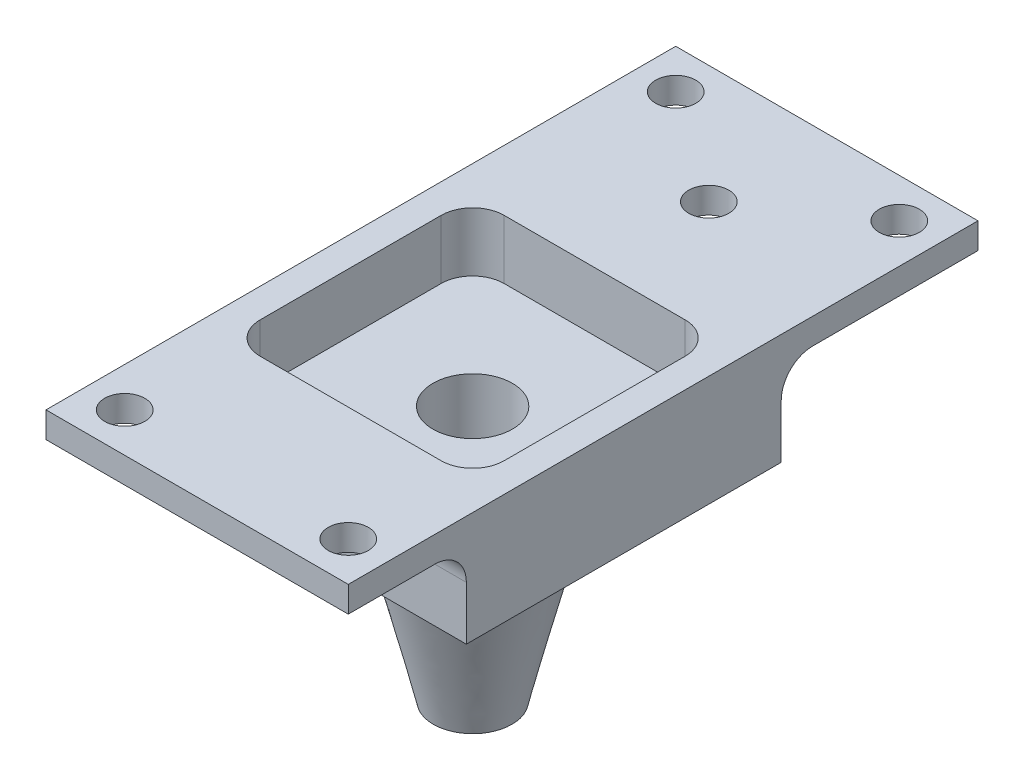
ISO-10303-21;
HEADER;
FILE_DESCRIPTION(('STEP AP214'),'2;1');
FILE_NAME('part.step','',(''),(''),'','','');
FILE_SCHEMA(('AUTOMOTIVE_DESIGN { 1 0 10303 214 1 1 1 1 }'));
ENDSEC;
DATA;
#1=APPLICATION_CONTEXT('core data for automotive mechanical design processes');
#2=APPLICATION_PROTOCOL_DEFINITION('international standard','automotive_design',2000,#1);
#3=PRODUCT_CONTEXT('',#1,'mechanical');
#4=PRODUCT('Part','Part','',(#3));
#5=PRODUCT_RELATED_PRODUCT_CATEGORY('part','',(#4));
#6=PRODUCT_DEFINITION_FORMATION('','',#4);
#7=PRODUCT_DEFINITION_CONTEXT('part definition',#1,'design');
#8=PRODUCT_DEFINITION('design','',#6,#7);
#9=PRODUCT_DEFINITION_SHAPE('','',#8);
#10=(LENGTH_UNIT() NAMED_UNIT(*) SI_UNIT(.MILLI.,.METRE.));
#11=(NAMED_UNIT(*) PLANE_ANGLE_UNIT() SI_UNIT($,.RADIAN.));
#12=(NAMED_UNIT(*) SI_UNIT($,.STERADIAN.) SOLID_ANGLE_UNIT());
#13=UNCERTAINTY_MEASURE_WITH_UNIT(LENGTH_MEASURE(1.E-05),#10,'distance_accuracy_value','');
#14=(GEOMETRIC_REPRESENTATION_CONTEXT(3) GLOBAL_UNCERTAINTY_ASSIGNED_CONTEXT((#13)) GLOBAL_UNIT_ASSIGNED_CONTEXT((#10,
#11,#12)) REPRESENTATION_CONTEXT('',''));
#15=CARTESIAN_POINT('',(0.,0.,0.));
#16=DIRECTION('',(0.,0.,1.));
#17=DIRECTION('',(1.,0.,0.));
#18=AXIS2_PLACEMENT_3D('',#15,#16,#17);
#19=CARTESIAN_POINT('',(-24.384,0.,50.8));
#20=DIRECTION('',(1.,0.,0.));
#21=DIRECTION('',(0.,0.,-1.));
#22=AXIS2_PLACEMENT_3D('',#19,#20,#21);
#23=PLANE('',#22);
#24=DIRECTION('',(0.,0.,-1.));
#25=VECTOR('',#24,1.);
#26=CARTESIAN_POINT('',(-24.384,-3.55599999999999,50.8));
#27=LINE('',#26,#25);
#28=CARTESIAN_POINT('',(-24.384,-3.556,31.75));
#29=VERTEX_POINT('',#28);
#30=CARTESIAN_POINT('',(-24.384,-3.55599999999999,-19.05));
#31=VERTEX_POINT('',#30);
#32=EDGE_CURVE('E241',#29,#31,#27,.T.);
#33=ORIENTED_EDGE('',*,*,#32,.F.);
#34=DIRECTION('',(0.,-1.,0.));
#35=VECTOR('',#34,1.);
#36=CARTESIAN_POINT('',(-24.384,10.16,31.75));
#37=LINE('',#36,#35);
#38=CARTESIAN_POINT('',(-24.384,5.08,31.75));
#39=VERTEX_POINT('',#38);
#40=EDGE_CURVE('E252',#39,#29,#37,.T.);
#41=ORIENTED_EDGE('',*,*,#40,.F.);
#42=CARTESIAN_POINT('',(-24.384,5.08,36.83));
#43=DIRECTION('',(1.,0.,0.));
#44=DIRECTION('',(0.,0.,-1.));
#45=AXIS2_PLACEMENT_3D('',#42,#43,#44);
#46=CIRCLE('',#45,5.08);
#47=CARTESIAN_POINT('',(-24.384,10.16,36.83));
#48=VERTEX_POINT('',#47);
#49=EDGE_CURVE('E349',#39,#48,#46,.T.);
#50=ORIENTED_EDGE('',*,*,#49,.T.);
#51=DIRECTION('',(0.,0.,1.));
#52=VECTOR('',#51,1.);
#53=CARTESIAN_POINT('',(-24.384,10.16,50.8));
#54=LINE('',#53,#52);
#55=CARTESIAN_POINT('',(-24.384,10.16,50.8));
#56=VERTEX_POINT('',#55);
#57=EDGE_CURVE('E267',#48,#56,#54,.T.);
#58=ORIENTED_EDGE('',*,*,#57,.T.);
#59=DIRECTION('',(0.,-1.,0.));
#60=VECTOR('',#59,1.);
#61=CARTESIAN_POINT('',(-24.384,0.,50.8));
#62=LINE('',#61,#60);
#63=CARTESIAN_POINT('',(-24.384,14.3256,50.8));
#64=VERTEX_POINT('',#63);
#65=EDGE_CURVE('E299',#64,#56,#62,.T.);
#66=ORIENTED_EDGE('',*,*,#65,.F.);
#67=DIRECTION('',(0.,0.,-1.));
#68=VECTOR('',#67,1.);
#69=CARTESIAN_POINT('',(-24.384,14.3256,50.8));
#70=LINE('',#69,#68);
#71=CARTESIAN_POINT('',(-24.384,14.3256,-50.8));
#72=VERTEX_POINT('',#71);
#73=EDGE_CURVE('E314',#64,#72,#70,.T.);
#74=ORIENTED_EDGE('',*,*,#73,.T.);
#75=DIRECTION('',(0.,-1.,0.));
#76=VECTOR('',#75,1.);
#77=CARTESIAN_POINT('',(-24.384,0.,-50.8));
#78=LINE('',#77,#76);
#79=CARTESIAN_POINT('',(-24.384,10.16,-50.8));
#80=VERTEX_POINT('',#79);
#81=EDGE_CURVE('E308',#72,#80,#78,.T.);
#82=ORIENTED_EDGE('',*,*,#81,.T.);
#83=DIRECTION('',(0.,0.,1.));
#84=VECTOR('',#83,1.);
#85=CARTESIAN_POINT('',(-24.384,10.16,50.8));
#86=LINE('',#85,#84);
#87=CARTESIAN_POINT('',(-24.384,10.16,-24.13));
#88=VERTEX_POINT('',#87);
#89=EDGE_CURVE('E274',#80,#88,#86,.T.);
#90=ORIENTED_EDGE('',*,*,#89,.T.);
#91=CARTESIAN_POINT('',(-24.384,5.08,-24.13));
#92=DIRECTION('',(1.,0.,0.));
#93=DIRECTION('',(0.,0.,-1.));
#94=AXIS2_PLACEMENT_3D('',#91,#92,#93);
#95=CIRCLE('',#94,5.08);
#96=CARTESIAN_POINT('',(-24.384,5.08,-19.05));
#97=VERTEX_POINT('',#96);
#98=EDGE_CURVE('E345',#88,#97,#95,.T.);
#99=ORIENTED_EDGE('',*,*,#98,.T.);
#100=DIRECTION('',(0.,-1.,0.));
#101=VECTOR('',#100,1.);
#102=CARTESIAN_POINT('',(-24.384,10.16,-19.05));
#103=LINE('',#102,#101);
#104=EDGE_CURVE('E255',#97,#31,#103,.T.);
#105=ORIENTED_EDGE('',*,*,#104,.T.);
#106=EDGE_LOOP('',(#33,#41,#50,#58,#66,#74,#82,#90,#99,#105));
#107=FACE_BOUND('',#106,.T.);
#108=ADVANCED_FACE('F114',(#107),#23,.F.);
#109=CARTESIAN_POINT('',(24.384,0.,50.8));
#110=DIRECTION('',(-1.,0.,0.));
#111=DIRECTION('',(0.,0.,1.));
#112=AXIS2_PLACEMENT_3D('',#109,#110,#111);
#113=PLANE('',#112);
#114=DIRECTION('',(0.,0.,1.));
#115=VECTOR('',#114,1.);
#116=CARTESIAN_POINT('',(24.384,-3.55599999999999,50.8));
#117=LINE('',#116,#115);
#118=CARTESIAN_POINT('',(24.384,-3.55599999999999,-19.05));
#119=VERTEX_POINT('',#118);
#120=CARTESIAN_POINT('',(24.384,-3.55599999999999,31.75));
#121=VERTEX_POINT('',#120);
#122=EDGE_CURVE('E129',#119,#121,#117,.T.);
#123=ORIENTED_EDGE('',*,*,#122,.F.);
#124=DIRECTION('',(0.,-1.,0.));
#125=VECTOR('',#124,1.);
#126=CARTESIAN_POINT('',(24.384,10.16,-19.05));
#127=LINE('',#126,#125);
#128=CARTESIAN_POINT('',(24.384,5.08,-19.05));
#129=VERTEX_POINT('',#128);
#130=EDGE_CURVE('E280',#129,#119,#127,.T.);
#131=ORIENTED_EDGE('',*,*,#130,.F.);
#132=CARTESIAN_POINT('',(24.384,5.08,-24.13));
#133=DIRECTION('',(-1.,0.,0.));
#134=DIRECTION('',(0.,0.,1.));
#135=AXIS2_PLACEMENT_3D('',#132,#133,#134);
#136=CIRCLE('',#135,5.08);
#137=CARTESIAN_POINT('',(24.384,10.16,-24.13));
#138=VERTEX_POINT('',#137);
#139=EDGE_CURVE('E343',#129,#138,#136,.T.);
#140=ORIENTED_EDGE('',*,*,#139,.T.);
#141=DIRECTION('',(0.,0.,-1.));
#142=VECTOR('',#141,1.);
#143=CARTESIAN_POINT('',(24.384,10.16,50.8));
#144=LINE('',#143,#142);
#145=CARTESIAN_POINT('',(24.384,10.16,-50.8));
#146=VERTEX_POINT('',#145);
#147=EDGE_CURVE('E278',#138,#146,#144,.T.);
#148=ORIENTED_EDGE('',*,*,#147,.T.);
#149=DIRECTION('',(0.,1.,0.));
#150=VECTOR('',#149,1.);
#151=CARTESIAN_POINT('',(24.384,0.,-50.8));
#152=LINE('',#151,#150);
#153=CARTESIAN_POINT('',(24.384,14.3256,-50.8));
#154=VERTEX_POINT('',#153);
#155=EDGE_CURVE('E300',#146,#154,#152,.T.);
#156=ORIENTED_EDGE('',*,*,#155,.T.);
#157=DIRECTION('',(0.,0.,-1.));
#158=VECTOR('',#157,1.);
#159=CARTESIAN_POINT('',(24.384,14.3256,50.8));
#160=LINE('',#159,#158);
#161=CARTESIAN_POINT('',(24.384,14.3256,50.8));
#162=VERTEX_POINT('',#161);
#163=EDGE_CURVE('E305',#162,#154,#160,.T.);
#164=ORIENTED_EDGE('',*,*,#163,.F.);
#165=DIRECTION('',(0.,1.,0.));
#166=VECTOR('',#165,1.);
#167=CARTESIAN_POINT('',(24.384,0.,50.8));
#168=LINE('',#167,#166);
#169=CARTESIAN_POINT('',(24.384,10.16,50.8));
#170=VERTEX_POINT('',#169);
#171=EDGE_CURVE('E303',#170,#162,#168,.T.);
#172=ORIENTED_EDGE('',*,*,#171,.F.);
#173=DIRECTION('',(0.,0.,-1.));
#174=VECTOR('',#173,1.);
#175=CARTESIAN_POINT('',(24.384,10.16,50.8));
#176=LINE('',#175,#174);
#177=CARTESIAN_POINT('',(24.384,10.16,36.83));
#178=VERTEX_POINT('',#177);
#179=EDGE_CURVE('E284',#170,#178,#176,.T.);
#180=ORIENTED_EDGE('',*,*,#179,.T.);
#181=CARTESIAN_POINT('',(24.384,5.08,36.83));
#182=DIRECTION('',(-1.,0.,0.));
#183=DIRECTION('',(0.,0.,1.));
#184=AXIS2_PLACEMENT_3D('',#181,#182,#183);
#185=CIRCLE('',#184,5.08);
#186=CARTESIAN_POINT('',(24.384,5.08,31.75));
#187=VERTEX_POINT('',#186);
#188=EDGE_CURVE('E347',#178,#187,#185,.T.);
#189=ORIENTED_EDGE('',*,*,#188,.T.);
#190=DIRECTION('',(0.,-1.,0.));
#191=VECTOR('',#190,1.);
#192=CARTESIAN_POINT('',(24.384,10.16,31.75));
#193=LINE('',#192,#191);
#194=EDGE_CURVE('E261',#187,#121,#193,.T.);
#195=ORIENTED_EDGE('',*,*,#194,.T.);
#196=EDGE_LOOP('',(#123,#131,#140,#148,#156,#164,#172,#180,#189,#195));
#197=FACE_BOUND('',#196,.T.);
#198=ADVANCED_FACE('F375',(#197),#113,.F.);
#199=CARTESIAN_POINT('',(0.,10.16,-19.05));
#200=DIRECTION('',(0.,0.,-1.));
#201=DIRECTION('',(-1.,0.,0.));
#202=AXIS2_PLACEMENT_3D('',#199,#200,#201);
#203=PLANE('',#202);
#204=ORIENTED_EDGE('',*,*,#130,.T.);
#205=DIRECTION('',(-1.,0.,0.));
#206=VECTOR('',#205,1.);
#207=CARTESIAN_POINT('',(0.,-3.55599999999999,-19.05));
#208=LINE('',#207,#206);
#209=EDGE_CURVE('E256',#119,#31,#208,.T.);
#210=ORIENTED_EDGE('',*,*,#209,.T.);
#211=ORIENTED_EDGE('',*,*,#104,.F.);
#212=DIRECTION('',(1.,0.,0.));
#213=VECTOR('',#212,1.);
#214=CARTESIAN_POINT('',(0.,5.08,-19.05));
#215=LINE('',#214,#213);
#216=EDGE_CURVE('E316',#97,#129,#215,.T.);
#217=ORIENTED_EDGE('',*,*,#216,.T.);
#218=EDGE_LOOP('',(#204,#210,#211,#217));
#219=FACE_BOUND('',#218,.T.);
#220=ADVANCED_FACE('F380',(#219),#203,.T.);
#221=CARTESIAN_POINT('',(0.,10.16,31.75));
#222=DIRECTION('',(0.,0.,-1.));
#223=DIRECTION('',(-1.,0.,0.));
#224=AXIS2_PLACEMENT_3D('',#221,#222,#223);
#225=PLANE('',#224);
#226=DIRECTION('',(-1.,0.,0.));
#227=VECTOR('',#226,1.);
#228=CARTESIAN_POINT('',(0.,-3.55599999999999,31.75));
#229=LINE('',#228,#227);
#230=EDGE_CURVE('E238',#121,#29,#229,.T.);
#231=ORIENTED_EDGE('',*,*,#230,.F.);
#232=ORIENTED_EDGE('',*,*,#194,.F.);
#233=DIRECTION('',(1.,0.,0.));
#234=VECTOR('',#233,1.);
#235=CARTESIAN_POINT('',(0.,5.08,31.75));
#236=LINE('',#235,#234);
#237=EDGE_CURVE('E260',#187,#39,#236,.F.);
#238=ORIENTED_EDGE('',*,*,#237,.T.);
#239=ORIENTED_EDGE('',*,*,#40,.T.);
#240=EDGE_LOOP('',(#231,#232,#238,#239));
#241=FACE_BOUND('',#240,.T.);
#242=ADVANCED_FACE('F258',(#241),#225,.F.);
#243=CARTESIAN_POINT('',(0.,-36.4744,6.35));
#244=DIRECTION('',(0.,1.,0.));
#245=DIRECTION('',(0.,0.,1.));
#246=AXIS2_PLACEMENT_3D('',#243,#244,#245);
#247=PLANE('',#246);
#248=CARTESIAN_POINT('',(0.,-36.4744,6.35));
#249=DIRECTION('',(0.,1.,0.));
#250=DIRECTION('',(0.,0.,1.));
#251=AXIS2_PLACEMENT_3D('',#248,#249,#250);
#252=CIRCLE('',#251,6.35);
#253=CARTESIAN_POINT('',(-6.24832481410187,-36.4744,7.48178488127329));
#254=VERTEX_POINT('',#253);
#255=EDGE_CURVE('E530',#254,#254,#252,.T.);
#256=ORIENTED_EDGE('',*,*,#255,.F.);
#257=EDGE_LOOP('',(#256));
#258=FACE_BOUND('',#257,.T.);
#259=CARTESIAN_POINT('',(0.,-36.4744,6.35));
#260=DIRECTION('',(0.,1.,0.));
#261=DIRECTION('',(0.,0.,1.));
#262=AXIS2_PLACEMENT_3D('',#259,#260,#261);
#263=CIRCLE('',#262,3.2385);
#264=CARTESIAN_POINT('',(0.,-36.4744,9.5885));
#265=VERTEX_POINT('',#264);
#266=EDGE_CURVE('E527',#265,#265,#263,.T.);
#267=ORIENTED_EDGE('',*,*,#266,.T.);
#268=EDGE_LOOP('',(#267));
#269=FACE_BOUND('',#268,.T.);
#270=ADVANCED_FACE('F554',(#258,#269),#247,.F.);
#271=CARTESIAN_POINT('',(0.,-11.177,6.35));
#272=DIRECTION('',(0.,1.,0.));
#273=DIRECTION('',(0.,0.,1.));
#274=AXIS2_PLACEMENT_3D('',#271,#272,#273);
#275=CYLINDRICAL_SURFACE('',#274,6.4135);
#276=CARTESIAN_POINT('',(0.,-11.176,6.35));
#277=DIRECTION('',(0.,-1.,0.));
#278=DIRECTION('',(1.,0.,0.));
#279=AXIS2_PLACEMENT_3D('',#276,#277,#278);
#280=CIRCLE('',#279,6.4135);
#281=CARTESIAN_POINT('',(6.4135,-11.176,6.35));
#282=VERTEX_POINT('',#281);
#283=EDGE_CURVE('E524',#282,#282,#280,.T.);
#284=ORIENTED_EDGE('',*,*,#283,.T.);
#285=EDGE_LOOP('',(#284));
#286=FACE_BOUND('',#285,.T.);
#287=CARTESIAN_POINT('',(0.,4.80059999999999,6.35));
#288=DIRECTION('',(0.,1.,0.));
#289=DIRECTION('',(0.,0.,1.));
#290=AXIS2_PLACEMENT_3D('',#287,#288,#289);
#291=CIRCLE('',#290,6.4135);
#292=CARTESIAN_POINT('',(0.,4.80059999999999,12.7635));
#293=VERTEX_POINT('',#292);
#294=EDGE_CURVE('E357',#293,#293,#291,.F.);
#295=ORIENTED_EDGE('',*,*,#294,.F.);
#296=EDGE_LOOP('',(#295));
#297=FACE_BOUND('',#296,.T.);
#298=ADVANCED_FACE('F562',(#286,#297),#275,.F.);
#299=CARTESIAN_POINT('',(0.,0.,50.8));
#300=DIRECTION('',(0.,0.,1.));
#301=DIRECTION('',(1.,0.,0.));
#302=AXIS2_PLACEMENT_3D('',#299,#300,#301);
#303=PLANE('',#302);
#304=ORIENTED_EDGE('',*,*,#65,.T.);
#305=DIRECTION('',(1.,0.,0.));
#306=VECTOR('',#305,1.);
#307=CARTESIAN_POINT('',(0.,10.16,50.8));
#308=LINE('',#307,#306);
#309=EDGE_CURVE('E262',#56,#170,#308,.T.);
#310=ORIENTED_EDGE('',*,*,#309,.T.);
#311=ORIENTED_EDGE('',*,*,#171,.T.);
#312=DIRECTION('',(1.,0.,0.));
#313=VECTOR('',#312,1.);
#314=CARTESIAN_POINT('',(0.,14.3256,50.8));
#315=LINE('',#314,#313);
#316=EDGE_CURVE('E296',#64,#162,#315,.T.);
#317=ORIENTED_EDGE('',*,*,#316,.F.);
#318=EDGE_LOOP('',(#304,#310,#311,#317));
#319=FACE_BOUND('',#318,.T.);
#320=ADVANCED_FACE('F389',(#319),#303,.T.);
#321=CARTESIAN_POINT('',(0.,14.3256,50.8));
#322=DIRECTION('',(0.,1.,0.));
#323=DIRECTION('',(0.,0.,1.));
#324=AXIS2_PLACEMENT_3D('',#321,#322,#323);
#325=PLANE('',#324);
#326=CARTESIAN_POINT('',(0.,14.3256,-31.75));
#327=DIRECTION('',(0.,1.,0.));
#328=DIRECTION('',(0.,0.,1.));
#329=AXIS2_PLACEMENT_3D('',#326,#327,#328);
#330=CIRCLE('',#329,3.2385);
#331=CARTESIAN_POINT('',(0.,14.3256,-28.5115));
#332=VERTEX_POINT('',#331);
#333=EDGE_CURVE('E359',#332,#332,#330,.T.);
#334=ORIENTED_EDGE('',*,*,#333,.F.);
#335=EDGE_LOOP('',(#334));
#336=FACE_BOUND('',#335,.T.);
#337=CARTESIAN_POINT('',(18.034,14.3256,44.45));
#338=DIRECTION('',(0.,1.,0.));
#339=DIRECTION('',(0.,0.,1.));
#340=AXIS2_PLACEMENT_3D('',#337,#338,#339);
#341=CIRCLE('',#340,3.2385);
#342=CARTESIAN_POINT('',(18.034,14.3256,47.6885));
#343=VERTEX_POINT('',#342);
#344=EDGE_CURVE('E472',#343,#343,#341,.T.);
#345=ORIENTED_EDGE('',*,*,#344,.F.);
#346=EDGE_LOOP('',(#345));
#347=FACE_BOUND('',#346,.T.);
#348=CARTESIAN_POINT('',(-18.0340000000003,14.3256,-44.45));
#349=DIRECTION('',(0.,1.,0.));
#350=DIRECTION('',(0.,0.,1.));
#351=AXIS2_PLACEMENT_3D('',#348,#349,#350);
#352=CIRCLE('',#351,3.2385);
#353=CARTESIAN_POINT('',(-18.0340000000003,14.3256,-41.2115));
#354=VERTEX_POINT('',#353);
#355=EDGE_CURVE('E471',#354,#354,#352,.T.);
#356=ORIENTED_EDGE('',*,*,#355,.F.);
#357=EDGE_LOOP('',(#356));
#358=FACE_BOUND('',#357,.T.);
#359=CARTESIAN_POINT('',(18.0339999999997,14.3256,-44.45));
#360=DIRECTION('',(0.,1.,0.));
#361=DIRECTION('',(0.,0.,1.));
#362=AXIS2_PLACEMENT_3D('',#359,#360,#361);
#363=CIRCLE('',#362,3.2385);
#364=CARTESIAN_POINT('',(18.0339999999997,14.3256,-41.2115));
#365=VERTEX_POINT('',#364);
#366=EDGE_CURVE('E468',#365,#365,#363,.T.);
#367=ORIENTED_EDGE('',*,*,#366,.F.);
#368=EDGE_LOOP('',(#367));
#369=FACE_BOUND('',#368,.T.);
#370=CARTESIAN_POINT('',(-18.034,14.3256,44.45));
#371=DIRECTION('',(0.,1.,0.));
#372=DIRECTION('',(0.,0.,1.));
#373=AXIS2_PLACEMENT_3D('',#370,#371,#372);
#374=CIRCLE('',#373,3.2385);
#375=CARTESIAN_POINT('',(-18.034,14.3256,47.6885));
#376=VERTEX_POINT('',#375);
#377=EDGE_CURVE('E475',#376,#376,#374,.T.);
#378=ORIENTED_EDGE('',*,*,#377,.F.);
#379=EDGE_LOOP('',(#378));
#380=FACE_BOUND('',#379,.T.);
#381=DIRECTION('',(1.,0.,0.));
#382=VECTOR('',#381,1.);
#383=CARTESIAN_POINT('',(0.,14.3256,-50.8));
#384=LINE('',#383,#382);
#385=EDGE_CURVE('E294',#72,#154,#384,.T.);
#386=ORIENTED_EDGE('',*,*,#385,.F.);
#387=ORIENTED_EDGE('',*,*,#73,.F.);
#388=ORIENTED_EDGE('',*,*,#316,.T.);
#389=ORIENTED_EDGE('',*,*,#163,.T.);
#390=EDGE_LOOP('',(#386,#387,#388,#389));
#391=FACE_BOUND('',#390,.T.);
#392=DIRECTION('',(0.,0.,1.));
#393=VECTOR('',#392,1.);
#394=CARTESIAN_POINT('',(-19.685,14.3256,-13.335));
#395=LINE('',#394,#393);
#396=CARTESIAN_POINT('',(-19.685,14.3256,-8.255));
#397=VERTEX_POINT('',#396);
#398=CARTESIAN_POINT('',(-19.685,14.3256,20.955));
#399=VERTEX_POINT('',#398);
#400=EDGE_CURVE('E290',#397,#399,#395,.T.);
#401=ORIENTED_EDGE('',*,*,#400,.F.);
#402=CARTESIAN_POINT('',(-14.605,14.3256,-8.255));
#403=DIRECTION('',(0.,1.,0.));
#404=DIRECTION('',(0.,0.,1.));
#405=AXIS2_PLACEMENT_3D('',#402,#403,#404);
#406=CIRCLE('',#405,5.08);
#407=CARTESIAN_POINT('',(-14.605,14.3256,-13.335));
#408=VERTEX_POINT('',#407);
#409=EDGE_CURVE('E247',#397,#408,#406,.F.);
#410=ORIENTED_EDGE('',*,*,#409,.T.);
#411=DIRECTION('',(1.,0.,0.));
#412=VECTOR('',#411,1.);
#413=CARTESIAN_POINT('',(0.,14.3256,-13.335));
#414=LINE('',#413,#412);
#415=CARTESIAN_POINT('',(14.605,14.3256,-13.335));
#416=VERTEX_POINT('',#415);
#417=EDGE_CURVE('E287',#408,#416,#414,.T.);
#418=ORIENTED_EDGE('',*,*,#417,.T.);
#419=CARTESIAN_POINT('',(14.605,14.3256,-8.255));
#420=DIRECTION('',(0.,1.,0.));
#421=DIRECTION('',(0.,0.,1.));
#422=AXIS2_PLACEMENT_3D('',#419,#420,#421);
#423=CIRCLE('',#422,5.08);
#424=CARTESIAN_POINT('',(19.685,14.3256,-8.255));
#425=VERTEX_POINT('',#424);
#426=EDGE_CURVE('E353',#416,#425,#423,.F.);
#427=ORIENTED_EDGE('',*,*,#426,.T.);
#428=DIRECTION('',(0.,0.,1.));
#429=VECTOR('',#428,1.);
#430=CARTESIAN_POINT('',(19.685,14.3256,-13.335));
#431=LINE('',#430,#429);
#432=CARTESIAN_POINT('',(19.685,14.3256,20.955));
#433=VERTEX_POINT('',#432);
#434=EDGE_CURVE('E291',#425,#433,#431,.T.);
#435=ORIENTED_EDGE('',*,*,#434,.T.);
#436=CARTESIAN_POINT('',(14.605,14.3256,20.955));
#437=DIRECTION('',(0.,1.,0.));
#438=DIRECTION('',(0.,0.,1.));
#439=AXIS2_PLACEMENT_3D('',#436,#437,#438);
#440=CIRCLE('',#439,5.08);
#441=CARTESIAN_POINT('',(14.605,14.3256,26.035));
#442=VERTEX_POINT('',#441);
#443=EDGE_CURVE('E351',#433,#442,#440,.F.);
#444=ORIENTED_EDGE('',*,*,#443,.T.);
#445=DIRECTION('',(1.,0.,0.));
#446=VECTOR('',#445,1.);
#447=CARTESIAN_POINT('',(0.,14.3256,26.035));
#448=LINE('',#447,#446);
#449=CARTESIAN_POINT('',(-14.605,14.3256,26.035));
#450=VERTEX_POINT('',#449);
#451=EDGE_CURVE('E264',#450,#442,#448,.T.);
#452=ORIENTED_EDGE('',*,*,#451,.F.);
#453=CARTESIAN_POINT('',(-14.605,14.3256,20.955));
#454=DIRECTION('',(0.,1.,0.));
#455=DIRECTION('',(0.,0.,1.));
#456=AXIS2_PLACEMENT_3D('',#453,#454,#455);
#457=CIRCLE('',#456,5.08);
#458=EDGE_CURVE('E137',#450,#399,#457,.F.);
#459=ORIENTED_EDGE('',*,*,#458,.T.);
#460=EDGE_LOOP('',(#401,#410,#418,#427,#435,#444,#452,#459));
#461=FACE_BOUND('',#460,.T.);
#462=ADVANCED_FACE('F385',(#336,#347,#358,#369,#380,#391,#461),#325,.T.);
#463=CARTESIAN_POINT('',(0.,0.,-50.8));
#464=DIRECTION('',(0.,0.,1.));
#465=DIRECTION('',(1.,0.,0.));
#466=AXIS2_PLACEMENT_3D('',#463,#464,#465);
#467=PLANE('',#466);
#468=ORIENTED_EDGE('',*,*,#155,.F.);
#469=DIRECTION('',(-1.,0.,0.));
#470=VECTOR('',#469,1.);
#471=CARTESIAN_POINT('',(0.,10.16,-50.8));
#472=LINE('',#471,#470);
#473=EDGE_CURVE('E271',#146,#80,#472,.T.);
#474=ORIENTED_EDGE('',*,*,#473,.T.);
#475=ORIENTED_EDGE('',*,*,#81,.F.);
#476=ORIENTED_EDGE('',*,*,#385,.T.);
#477=EDGE_LOOP('',(#468,#474,#475,#476));
#478=FACE_BOUND('',#477,.T.);
#479=ADVANCED_FACE('F388',(#478),#467,.F.);
#480=CARTESIAN_POINT('',(19.685,0.,-13.335));
#481=DIRECTION('',(1.,0.,0.));
#482=DIRECTION('',(0.,1.,0.));
#483=AXIS2_PLACEMENT_3D('',#480,#481,#482);
#484=PLANE('',#483);
#485=DIRECTION('',(0.,1.,0.));
#486=VECTOR('',#485,1.);
#487=CARTESIAN_POINT('',(19.685,0.,-8.255));
#488=LINE('',#487,#486);
#489=CARTESIAN_POINT('',(19.685,4.80059999999999,-8.255));
#490=VERTEX_POINT('',#489);
#491=EDGE_CURVE('E325',#425,#490,#488,.F.);
#492=ORIENTED_EDGE('',*,*,#491,.T.);
#493=DIRECTION('',(0.,0.,-1.));
#494=VECTOR('',#493,1.);
#495=CARTESIAN_POINT('',(19.685,4.80059999999999,20.955));
#496=LINE('',#495,#494);
#497=CARTESIAN_POINT('',(19.685,4.80059999999999,20.955));
#498=VERTEX_POINT('',#497);
#499=EDGE_CURVE('E440',#498,#490,#496,.T.);
#500=ORIENTED_EDGE('',*,*,#499,.F.);
#501=DIRECTION('',(0.,1.,0.));
#502=VECTOR('',#501,1.);
#503=CARTESIAN_POINT('',(19.685,14.3256,20.955));
#504=LINE('',#503,#502);
#505=EDGE_CURVE('E327',#498,#433,#504,.T.);
#506=ORIENTED_EDGE('',*,*,#505,.T.);
#507=ORIENTED_EDGE('',*,*,#434,.F.);
#508=EDGE_LOOP('',(#492,#500,#506,#507));
#509=FACE_BOUND('',#508,.T.);
#510=ADVANCED_FACE('F438',(#509),#484,.F.);
#511=CARTESIAN_POINT('',(-19.685,0.,-13.335));
#512=DIRECTION('',(-1.,0.,0.));
#513=DIRECTION('',(0.,-1.,0.));
#514=AXIS2_PLACEMENT_3D('',#511,#512,#513);
#515=PLANE('',#514);
#516=ORIENTED_EDGE('',*,*,#400,.T.);
#517=DIRECTION('',(0.,-1.,0.));
#518=VECTOR('',#517,1.);
#519=CARTESIAN_POINT('',(-19.685,10.16,20.955));
#520=LINE('',#519,#518);
#521=CARTESIAN_POINT('',(-19.685,4.80059999999999,20.955));
#522=VERTEX_POINT('',#521);
#523=EDGE_CURVE('E341',#399,#522,#520,.T.);
#524=ORIENTED_EDGE('',*,*,#523,.T.);
#525=DIRECTION('',(0.,0.,1.));
#526=VECTOR('',#525,1.);
#527=CARTESIAN_POINT('',(-19.685,4.80059999999999,-8.255));
#528=LINE('',#527,#526);
#529=CARTESIAN_POINT('',(-19.685,4.80059999999999,-8.255));
#530=VERTEX_POINT('',#529);
#531=EDGE_CURVE('E360',#530,#522,#528,.T.);
#532=ORIENTED_EDGE('',*,*,#531,.F.);
#533=DIRECTION('',(0.,-1.,0.));
#534=VECTOR('',#533,1.);
#535=CARTESIAN_POINT('',(-19.685,0.,-8.255));
#536=LINE('',#535,#534);
#537=EDGE_CURVE('E339',#530,#397,#536,.F.);
#538=ORIENTED_EDGE('',*,*,#537,.T.);
#539=EDGE_LOOP('',(#516,#524,#532,#538));
#540=FACE_BOUND('',#539,.T.);
#541=ADVANCED_FACE('F457',(#540),#515,.F.);
#542=CARTESIAN_POINT('',(0.,0.,-13.335));
#543=DIRECTION('',(0.,0.,1.));
#544=DIRECTION('',(1.,0.,0.));
#545=AXIS2_PLACEMENT_3D('',#542,#543,#544);
#546=PLANE('',#545);
#547=DIRECTION('',(0.,-1.,0.));
#548=VECTOR('',#547,1.);
#549=CARTESIAN_POINT('',(-14.605,0.,-13.335));
#550=LINE('',#549,#548);
#551=CARTESIAN_POINT('',(-14.605,4.80059999999999,-13.335));
#552=VERTEX_POINT('',#551);
#553=EDGE_CURVE('E334',#408,#552,#550,.T.);
#554=ORIENTED_EDGE('',*,*,#553,.T.);
#555=DIRECTION('',(-1.,0.,0.));
#556=VECTOR('',#555,1.);
#557=CARTESIAN_POINT('',(14.605,4.80059999999999,-13.335));
#558=LINE('',#557,#556);
#559=CARTESIAN_POINT('',(14.605,4.80059999999999,-13.335));
#560=VERTEX_POINT('',#559);
#561=EDGE_CURVE('E430',#560,#552,#558,.T.);
#562=ORIENTED_EDGE('',*,*,#561,.F.);
#563=DIRECTION('',(0.,1.,0.));
#564=VECTOR('',#563,1.);
#565=CARTESIAN_POINT('',(14.605,0.,-13.335));
#566=LINE('',#565,#564);
#567=EDGE_CURVE('E336',#560,#416,#566,.T.);
#568=ORIENTED_EDGE('',*,*,#567,.T.);
#569=ORIENTED_EDGE('',*,*,#417,.F.);
#570=EDGE_LOOP('',(#554,#562,#568,#569));
#571=FACE_BOUND('',#570,.T.);
#572=ADVANCED_FACE('F427',(#571),#546,.T.);
#573=CARTESIAN_POINT('',(0.,0.,26.035));
#574=DIRECTION('',(0.,0.,1.));
#575=DIRECTION('',(1.,0.,0.));
#576=AXIS2_PLACEMENT_3D('',#573,#574,#575);
#577=PLANE('',#576);
#578=ORIENTED_EDGE('',*,*,#451,.T.);
#579=DIRECTION('',(0.,1.,0.));
#580=VECTOR('',#579,1.);
#581=CARTESIAN_POINT('',(14.605,10.16,26.035));
#582=LINE('',#581,#580);
#583=CARTESIAN_POINT('',(14.605,4.80059999999999,26.035));
#584=VERTEX_POINT('',#583);
#585=EDGE_CURVE('E332',#442,#584,#582,.F.);
#586=ORIENTED_EDGE('',*,*,#585,.T.);
#587=DIRECTION('',(1.,0.,0.));
#588=VECTOR('',#587,1.);
#589=CARTESIAN_POINT('',(-14.605,4.80059999999999,26.035));
#590=LINE('',#589,#588);
#591=CARTESIAN_POINT('',(-14.605,4.80059999999999,26.035));
#592=VERTEX_POINT('',#591);
#593=EDGE_CURVE('E449',#592,#584,#590,.T.);
#594=ORIENTED_EDGE('',*,*,#593,.F.);
#595=DIRECTION('',(0.,-1.,0.));
#596=VECTOR('',#595,1.);
#597=CARTESIAN_POINT('',(-14.605,14.3256,26.035));
#598=LINE('',#597,#596);
#599=EDGE_CURVE('E330',#592,#450,#598,.F.);
#600=ORIENTED_EDGE('',*,*,#599,.T.);
#601=EDGE_LOOP('',(#578,#586,#594,#600));
#602=FACE_BOUND('',#601,.T.);
#603=ADVANCED_FACE('F447',(#602),#577,.F.);
#604=CARTESIAN_POINT('',(0.,10.16,0.));
#605=DIRECTION('',(0.,1.,0.));
#606=DIRECTION('',(0.,0.,1.));
#607=AXIS2_PLACEMENT_3D('',#604,#605,#606);
#608=PLANE('',#607);
#609=CARTESIAN_POINT('',(0.,10.16,-31.75));
#610=DIRECTION('',(0.,1.,0.));
#611=DIRECTION('',(0.,0.,1.));
#612=AXIS2_PLACEMENT_3D('',#609,#610,#611);
#613=CIRCLE('',#612,3.2385);
#614=CARTESIAN_POINT('',(0.,10.16,-28.5115));
#615=VERTEX_POINT('',#614);
#616=EDGE_CURVE('E465',#615,#615,#613,.F.);
#617=ORIENTED_EDGE('',*,*,#616,.F.);
#618=EDGE_LOOP('',(#617));
#619=FACE_BOUND('',#618,.T.);
#620=CARTESIAN_POINT('',(-18.0340000000003,10.16,-44.45));
#621=DIRECTION('',(0.,1.,0.));
#622=DIRECTION('',(0.,0.,1.));
#623=AXIS2_PLACEMENT_3D('',#620,#621,#622);
#624=CIRCLE('',#623,3.2385);
#625=CARTESIAN_POINT('',(-18.0340000000003,10.16,-41.2115));
#626=VERTEX_POINT('',#625);
#627=EDGE_CURVE('E486',#626,#626,#624,.T.);
#628=ORIENTED_EDGE('',*,*,#627,.T.);
#629=EDGE_LOOP('',(#628));
#630=FACE_BOUND('',#629,.T.);
#631=ORIENTED_EDGE('',*,*,#147,.F.);
#632=DIRECTION('',(1.,0.,0.));
#633=VECTOR('',#632,1.);
#634=CARTESIAN_POINT('',(0.,10.16,-24.13));
#635=LINE('',#634,#633);
#636=EDGE_CURVE('E319',#138,#88,#635,.F.);
#637=ORIENTED_EDGE('',*,*,#636,.T.);
#638=ORIENTED_EDGE('',*,*,#89,.F.);
#639=ORIENTED_EDGE('',*,*,#473,.F.);
#640=EDGE_LOOP('',(#631,#637,#638,#639));
#641=FACE_BOUND('',#640,.T.);
#642=CARTESIAN_POINT('',(18.0339999999997,10.16,-44.45));
#643=DIRECTION('',(0.,1.,0.));
#644=DIRECTION('',(0.,0.,1.));
#645=AXIS2_PLACEMENT_3D('',#642,#643,#644);
#646=CIRCLE('',#645,3.2385);
#647=CARTESIAN_POINT('',(18.0339999999997,10.16,-41.2115));
#648=VERTEX_POINT('',#647);
#649=EDGE_CURVE('E275',#648,#648,#646,.T.);
#650=ORIENTED_EDGE('',*,*,#649,.T.);
#651=EDGE_LOOP('',(#650));
#652=FACE_BOUND('',#651,.T.);
#653=ADVANCED_FACE('F511',(#619,#630,#641,#652),#608,.F.);
#654=CARTESIAN_POINT('',(0.,10.16,0.));
#655=DIRECTION('',(0.,-1.,0.));
#656=DIRECTION('',(0.,0.,-1.));
#657=AXIS2_PLACEMENT_3D('',#654,#655,#656);
#658=PLANE('',#657);
#659=ORIENTED_EDGE('',*,*,#57,.F.);
#660=DIRECTION('',(1.,0.,0.));
#661=VECTOR('',#660,1.);
#662=CARTESIAN_POINT('',(0.,10.16,36.83));
#663=LINE('',#662,#661);
#664=EDGE_CURVE('E321',#48,#178,#663,.T.);
#665=ORIENTED_EDGE('',*,*,#664,.T.);
#666=ORIENTED_EDGE('',*,*,#179,.F.);
#667=ORIENTED_EDGE('',*,*,#309,.F.);
#668=EDGE_LOOP('',(#659,#665,#666,#667));
#669=FACE_BOUND('',#668,.T.);
#670=CARTESIAN_POINT('',(-18.034,10.16,44.45));
#671=DIRECTION('',(0.,-1.,0.));
#672=DIRECTION('',(0.,0.,-1.));
#673=AXIS2_PLACEMENT_3D('',#670,#671,#672);
#674=CIRCLE('',#673,3.2385);
#675=CARTESIAN_POINT('',(-18.034,10.16,41.2115));
#676=VERTEX_POINT('',#675);
#677=EDGE_CURVE('E480',#676,#676,#674,.T.);
#678=ORIENTED_EDGE('',*,*,#677,.F.);
#679=EDGE_LOOP('',(#678));
#680=FACE_BOUND('',#679,.T.);
#681=CARTESIAN_POINT('',(18.034,10.16,44.45));
#682=DIRECTION('',(0.,-1.,0.));
#683=DIRECTION('',(0.,0.,-1.));
#684=AXIS2_PLACEMENT_3D('',#681,#682,#683);
#685=CIRCLE('',#684,3.2385);
#686=CARTESIAN_POINT('',(18.034,10.16,41.2115));
#687=VERTEX_POINT('',#686);
#688=EDGE_CURVE('E483',#687,#687,#685,.T.);
#689=ORIENTED_EDGE('',*,*,#688,.F.);
#690=EDGE_LOOP('',(#689));
#691=FACE_BOUND('',#690,.T.);
#692=ADVANCED_FACE('F498',(#669,#680,#691),#658,.T.);
#693=CARTESIAN_POINT('',(-18.034,-0.000999999999999265,44.45));
#694=DIRECTION('',(0.,1.,0.));
#695=DIRECTION('',(0.,0.,1.));
#696=AXIS2_PLACEMENT_3D('',#693,#694,#695);
#697=CYLINDRICAL_SURFACE('',#696,3.2385);
#698=ORIENTED_EDGE('',*,*,#677,.T.);
#699=EDGE_LOOP('',(#698));
#700=FACE_BOUND('',#699,.T.);
#701=ORIENTED_EDGE('',*,*,#377,.T.);
#702=EDGE_LOOP('',(#701));
#703=FACE_BOUND('',#702,.T.);
#704=ADVANCED_FACE('F601',(#700,#703),#697,.F.);
#705=CARTESIAN_POINT('',(18.034,-0.000999999999999265,44.45));
#706=DIRECTION('',(0.,1.,0.));
#707=DIRECTION('',(0.,0.,1.));
#708=AXIS2_PLACEMENT_3D('',#705,#706,#707);
#709=CYLINDRICAL_SURFACE('',#708,3.2385);
#710=ORIENTED_EDGE('',*,*,#688,.T.);
#711=EDGE_LOOP('',(#710));
#712=FACE_BOUND('',#711,.T.);
#713=ORIENTED_EDGE('',*,*,#344,.T.);
#714=EDGE_LOOP('',(#713));
#715=FACE_BOUND('',#714,.T.);
#716=ADVANCED_FACE('F597',(#712,#715),#709,.F.);
#717=CARTESIAN_POINT('',(18.0339999999997,-0.000999999999999265,-44.45));
#718=DIRECTION('',(0.,1.,0.));
#719=DIRECTION('',(0.,0.,1.));
#720=AXIS2_PLACEMENT_3D('',#717,#718,#719);
#721=CYLINDRICAL_SURFACE('',#720,3.2385);
#722=ORIENTED_EDGE('',*,*,#366,.T.);
#723=EDGE_LOOP('',(#722));
#724=FACE_BOUND('',#723,.T.);
#725=ORIENTED_EDGE('',*,*,#649,.F.);
#726=EDGE_LOOP('',(#725));
#727=FACE_BOUND('',#726,.T.);
#728=ADVANCED_FACE('F594',(#724,#727),#721,.F.);
#729=CARTESIAN_POINT('',(-18.0340000000003,-0.000999999999999265,-44.45));
#730=DIRECTION('',(0.,1.,0.));
#731=DIRECTION('',(0.,0.,1.));
#732=AXIS2_PLACEMENT_3D('',#729,#730,#731);
#733=CYLINDRICAL_SURFACE('',#732,3.2385);
#734=ORIENTED_EDGE('',*,*,#355,.T.);
#735=EDGE_LOOP('',(#734));
#736=FACE_BOUND('',#735,.T.);
#737=ORIENTED_EDGE('',*,*,#627,.F.);
#738=EDGE_LOOP('',(#737));
#739=FACE_BOUND('',#738,.T.);
#740=ADVANCED_FACE('F592',(#736,#739),#733,.F.);
#741=CARTESIAN_POINT('',(0.,-0.000999999999999265,-31.75));
#742=DIRECTION('',(0.,1.,0.));
#743=DIRECTION('',(0.,0.,1.));
#744=AXIS2_PLACEMENT_3D('',#741,#742,#743);
#745=CYLINDRICAL_SURFACE('',#744,3.2385);
#746=ORIENTED_EDGE('',*,*,#333,.T.);
#747=EDGE_LOOP('',(#746));
#748=FACE_BOUND('',#747,.T.);
#749=ORIENTED_EDGE('',*,*,#616,.T.);
#750=EDGE_LOOP('',(#749));
#751=FACE_BOUND('',#750,.T.);
#752=ADVANCED_FACE('F395',(#748,#751),#745,.F.);
#753=CARTESIAN_POINT('',(0.,5.08,-24.13));
#754=DIRECTION('',(1.,0.,0.));
#755=DIRECTION('',(0.,0.,-1.));
#756=AXIS2_PLACEMENT_3D('',#753,#754,#755);
#757=CYLINDRICAL_SURFACE('',#756,5.08);
#758=ORIENTED_EDGE('',*,*,#98,.F.);
#759=ORIENTED_EDGE('',*,*,#636,.F.);
#760=ORIENTED_EDGE('',*,*,#139,.F.);
#761=ORIENTED_EDGE('',*,*,#216,.F.);
#762=EDGE_LOOP('',(#758,#759,#760,#761));
#763=FACE_BOUND('',#762,.T.);
#764=ADVANCED_FACE('F391',(#763),#757,.F.);
#765=CARTESIAN_POINT('',(0.,5.08,36.83));
#766=DIRECTION('',(1.,0.,0.));
#767=DIRECTION('',(0.,0.,-1.));
#768=AXIS2_PLACEMENT_3D('',#765,#766,#767);
#769=CYLINDRICAL_SURFACE('',#768,5.08);
#770=ORIENTED_EDGE('',*,*,#49,.F.);
#771=ORIENTED_EDGE('',*,*,#237,.F.);
#772=ORIENTED_EDGE('',*,*,#188,.F.);
#773=ORIENTED_EDGE('',*,*,#664,.F.);
#774=EDGE_LOOP('',(#770,#771,#772,#773));
#775=FACE_BOUND('',#774,.T.);
#776=ADVANCED_FACE('F394',(#775),#769,.F.);
#777=CARTESIAN_POINT('',(14.605,0.,20.955));
#778=DIRECTION('',(0.,-1.,0.));
#779=DIRECTION('',(1.,0.,0.));
#780=AXIS2_PLACEMENT_3D('',#777,#778,#779);
#781=CYLINDRICAL_SURFACE('',#780,5.08);
#782=ORIENTED_EDGE('',*,*,#505,.F.);
#783=CARTESIAN_POINT('',(14.605,4.80059999999999,20.955));
#784=DIRECTION('',(0.,1.,0.));
#785=DIRECTION('',(0.,0.,1.));
#786=AXIS2_PLACEMENT_3D('',#783,#784,#785);
#787=CIRCLE('',#786,5.08);
#788=EDGE_CURVE('E444',#584,#498,#787,.T.);
#789=ORIENTED_EDGE('',*,*,#788,.F.);
#790=ORIENTED_EDGE('',*,*,#585,.F.);
#791=ORIENTED_EDGE('',*,*,#443,.F.);
#792=EDGE_LOOP('',(#782,#789,#790,#791));
#793=FACE_BOUND('',#792,.T.);
#794=ADVANCED_FACE('F399',(#793),#781,.F.);
#795=CARTESIAN_POINT('',(14.605,0.,-8.255));
#796=DIRECTION('',(0.,1.,0.));
#797=DIRECTION('',(-1.,0.,0.));
#798=AXIS2_PLACEMENT_3D('',#795,#796,#797);
#799=CYLINDRICAL_SURFACE('',#798,5.08);
#800=ORIENTED_EDGE('',*,*,#567,.F.);
#801=CARTESIAN_POINT('',(14.605,4.80059999999999,-8.255));
#802=DIRECTION('',(0.,1.,0.));
#803=DIRECTION('',(0.,0.,1.));
#804=AXIS2_PLACEMENT_3D('',#801,#802,#803);
#805=CIRCLE('',#804,5.08);
#806=EDGE_CURVE('E434',#490,#560,#805,.T.);
#807=ORIENTED_EDGE('',*,*,#806,.F.);
#808=ORIENTED_EDGE('',*,*,#491,.F.);
#809=ORIENTED_EDGE('',*,*,#426,.F.);
#810=EDGE_LOOP('',(#800,#807,#808,#809));
#811=FACE_BOUND('',#810,.T.);
#812=ADVANCED_FACE('F403',(#811),#799,.F.);
#813=CARTESIAN_POINT('',(-14.605,0.,20.955));
#814=DIRECTION('',(0.,1.,0.));
#815=DIRECTION('',(-1.,0.,0.));
#816=AXIS2_PLACEMENT_3D('',#813,#814,#815);
#817=CYLINDRICAL_SURFACE('',#816,5.08);
#818=ORIENTED_EDGE('',*,*,#458,.F.);
#819=ORIENTED_EDGE('',*,*,#599,.F.);
#820=CARTESIAN_POINT('',(-14.605,4.80059999999999,20.955));
#821=DIRECTION('',(0.,1.,0.));
#822=DIRECTION('',(0.,0.,1.));
#823=AXIS2_PLACEMENT_3D('',#820,#821,#822);
#824=CIRCLE('',#823,5.08);
#825=EDGE_CURVE('E453',#522,#592,#824,.T.);
#826=ORIENTED_EDGE('',*,*,#825,.F.);
#827=ORIENTED_EDGE('',*,*,#523,.F.);
#828=EDGE_LOOP('',(#818,#819,#826,#827));
#829=FACE_BOUND('',#828,.T.);
#830=ADVANCED_FACE('F407',(#829),#817,.F.);
#831=CARTESIAN_POINT('',(-14.605,0.,-8.255));
#832=DIRECTION('',(0.,-1.,0.));
#833=DIRECTION('',(1.,0.,0.));
#834=AXIS2_PLACEMENT_3D('',#831,#832,#833);
#835=CYLINDRICAL_SURFACE('',#834,5.08);
#836=ORIENTED_EDGE('',*,*,#409,.F.);
#837=ORIENTED_EDGE('',*,*,#537,.F.);
#838=CARTESIAN_POINT('',(-14.605,4.80059999999999,-8.255));
#839=DIRECTION('',(0.,1.,0.));
#840=DIRECTION('',(0.,0.,1.));
#841=AXIS2_PLACEMENT_3D('',#838,#839,#840);
#842=CIRCLE('',#841,5.08);
#843=EDGE_CURVE('E458',#552,#530,#842,.T.);
#844=ORIENTED_EDGE('',*,*,#843,.F.);
#845=ORIENTED_EDGE('',*,*,#553,.F.);
#846=EDGE_LOOP('',(#836,#837,#844,#845));
#847=FACE_BOUND('',#846,.T.);
#848=ADVANCED_FACE('F410',(#847),#835,.F.);
#849=CARTESIAN_POINT('',(-14.605,4.80059999999999,20.955));
#850=DIRECTION('',(0.,1.,0.));
#851=DIRECTION('',(0.,0.,1.));
#852=AXIS2_PLACEMENT_3D('',#849,#850,#851);
#853=PLANE('',#852);
#854=ORIENTED_EDGE('',*,*,#825,.T.);
#855=ORIENTED_EDGE('',*,*,#593,.T.);
#856=ORIENTED_EDGE('',*,*,#788,.T.);
#857=ORIENTED_EDGE('',*,*,#499,.T.);
#858=ORIENTED_EDGE('',*,*,#806,.T.);
#859=ORIENTED_EDGE('',*,*,#561,.T.);
#860=ORIENTED_EDGE('',*,*,#843,.T.);
#861=ORIENTED_EDGE('',*,*,#531,.T.);
#862=EDGE_LOOP('',(#854,#855,#856,#857,#858,#859,#860,#861));
#863=FACE_BOUND('',#862,.T.);
#864=ORIENTED_EDGE('',*,*,#294,.T.);
#865=EDGE_LOOP('',(#864));
#866=FACE_BOUND('',#865,.T.);
#867=ADVANCED_FACE('F413',(#863,#866),#853,.T.);
#868=CARTESIAN_POINT('',(-12.6051001647211,-11.176,4.80033879917279));
#869=CARTESIAN_POINT('',(-6.24832481410187,-36.4744,7.48178488127329));
#870=CARTESIAN_POINT('',(-9.50577776306664,-11.176,-20.4098615302693));
#871=CARTESIAN_POINT('',(-8.51189457664845,-36.4744,-5.01486474693046));
#872=CARTESIAN_POINT('',(15.7044225663755,-11.176,-17.3105391286149));
#873=CARTESIAN_POINT('',(3.9847550515553,-36.4744,-7.27843450947704));
#874=CARTESIAN_POINT('',(12.6051001647211,-11.176,7.89966120082721));
#875=CARTESIAN_POINT('',(6.24832481410187,-36.4744,5.21821511872671));
#876=CARTESIAN_POINT('',(9.50577776306663,-11.176,33.1098615302693));
#877=CARTESIAN_POINT('',(8.51189457664845,-36.4744,17.7148647469304));
#878=CARTESIAN_POINT('',(-15.7044225663755,-11.176,30.0105391286149));
#879=CARTESIAN_POINT('',(-3.98475505155529,-36.4744,19.978434509477));
#880=CARTESIAN_POINT('',(-12.6051001647211,-11.176,4.80033879917279));
#881=CARTESIAN_POINT('',(-6.24832481410187,-36.4744,7.48178488127329));
#882=(BOUNDED_SURFACE() B_SPLINE_SURFACE(3,1,((#868,#869),(#870,#871),(#872,#873),(#874,#875),
(#876,#877),(#878,#879),(#880,#881)),.UNSPECIFIED.,.T.,.F.,.F.) B_SPLINE_SURFACE_WITH_KNOTS((4,
3,4),(2,2),(0.,0.5,1.),(0.,1.),
.UNSPECIFIED.) GEOMETRIC_REPRESENTATION_ITEM() RATIONAL_B_SPLINE_SURFACE(((1.,1.),
(0.333333333333333,0.333333333333333),(0.333333333333333,0.333333333333333),(1.,1.),
(0.333333333333333,0.333333333333334),(0.333333333333333,0.333333333333334),(1.,1.))) REPRESENTATION_ITEM('') SURFACE());
#883=CARTESIAN_POINT('',(0.,-11.176,6.35));
#884=DIRECTION('',(0.,-1.,0.));
#885=DIRECTION('',(1.,0.,0.));
#886=AXIS2_PLACEMENT_3D('',#883,#884,#885);
#887=CIRCLE('',#886,12.7);
#888=CARTESIAN_POINT('',(-12.6051001647211,-11.176,4.80033879917279));
#889=VERTEX_POINT('',#888);
#890=EDGE_CURVE('E518',#889,#889,#887,.T.);
#891=CARTESIAN_POINT('',(-12.6051001647211,-11.176,4.80033879917279));
#892=CARTESIAN_POINT('',(-12.5388837548188,-11.439525,4.82827052919467));
#893=CARTESIAN_POINT('',(-12.4726673449165,-11.70305,4.85620225921655));
#894=CARTESIAN_POINT('',(-12.3402345251119,-12.2301,4.91206571926031));
#895=CARTESIAN_POINT('',(-12.2740181152096,-12.493625,4.93999744928219));
#896=CARTESIAN_POINT('',(-12.1415852954051,-13.020675,4.99586090932595));
#897=CARTESIAN_POINT('',(-12.0753688855028,-13.2842,5.02379263934783));
#898=CARTESIAN_POINT('',(-11.9429360656982,-13.81125,5.07965609939159));
#899=CARTESIAN_POINT('',(-11.8767196557959,-14.074775,5.10758782941347));
#900=CARTESIAN_POINT('',(-11.7442868359914,-14.601825,5.16345128945723));
#901=CARTESIAN_POINT('',(-11.6780704260891,-14.86535,5.19138301947911));
#902=CARTESIAN_POINT('',(-11.5456376062845,-15.3924,5.24724647952287));
#903=CARTESIAN_POINT('',(-11.4794211963822,-15.655925,5.27517820954475));
#904=CARTESIAN_POINT('',(-11.3469883765777,-16.182975,5.33104166958851));
#905=CARTESIAN_POINT('',(-11.2807719666754,-16.4465,5.35897339961039));
#906=CARTESIAN_POINT('',(-11.1483391468708,-16.97355,5.41483685965415));
#907=CARTESIAN_POINT('',(-11.0821227369685,-17.237075,5.44276858967604));
#908=CARTESIAN_POINT('',(-10.949689917164,-17.764125,5.4986320497198));
#909=CARTESIAN_POINT('',(-10.8834735072617,-18.02765,5.52656377974168));
#910=CARTESIAN_POINT('',(-10.7510406874571,-18.5547,5.58242723978544));
#911=CARTESIAN_POINT('',(-10.6848242775548,-18.818225,5.61035896980732));
#912=CARTESIAN_POINT('',(-10.5523914577503,-19.345275,5.66622242985108));
#913=CARTESIAN_POINT('',(-10.486175047848,-19.6088,5.69415415987296));
#914=CARTESIAN_POINT('',(-10.3537422280434,-20.13585,5.75001761991672));
#915=CARTESIAN_POINT('',(-10.2875258181411,-20.399375,5.7779493499386));
#916=CARTESIAN_POINT('',(-10.1550929983366,-20.926425,5.83381280998236));
#917=CARTESIAN_POINT('',(-10.0888765884343,-21.18995,5.86174454000424));
#918=CARTESIAN_POINT('',(-9.95644376862973,-21.717,5.917608000048));
#919=CARTESIAN_POINT('',(-9.89022735872745,-21.980525,5.94553973006988));
#920=CARTESIAN_POINT('',(-9.75779453892288,-22.507575,6.00140319011364));
#921=CARTESIAN_POINT('',(-9.6915781290206,-22.7711,6.02933492013552));
#922=CARTESIAN_POINT('',(-9.55914530921603,-23.29815,6.08519838017928));
#923=CARTESIAN_POINT('',(-9.49292889931375,-23.561675,6.11313011020116));
#924=CARTESIAN_POINT('',(-9.36049607950918,-24.088725,6.16899357024492));
#925=CARTESIAN_POINT('',(-9.2942796696069,-24.35225,6.1969253002668));
#926=CARTESIAN_POINT('',(-9.16184684980233,-24.8793,6.25278876031056));
#927=CARTESIAN_POINT('',(-9.09563043990005,-25.142825,6.28072049033244));
#928=CARTESIAN_POINT('',(-8.96319762009548,-25.669875,6.3365839503762));
#929=CARTESIAN_POINT('',(-8.8969812101932,-25.9334,6.36451568039808));
#930=CARTESIAN_POINT('',(-8.76454839038863,-26.46045,6.42037914044184));
#931=CARTESIAN_POINT('',(-8.69833198048635,-26.723975,6.44831087046372));
#932=CARTESIAN_POINT('',(-8.56589916068178,-27.251025,6.50417433050748));
#933=CARTESIAN_POINT('',(-8.4996827507795,-27.51455,6.53210606052936));
#934=CARTESIAN_POINT('',(-8.36724993097493,-28.0416,6.58796952057312));
#935=CARTESIAN_POINT('',(-8.30103352107265,-28.305125,6.615901250595));
#936=CARTESIAN_POINT('',(-8.16860070126808,-28.832175,6.67176471063876));
#937=CARTESIAN_POINT('',(-8.1023842913658,-29.0957,6.69969644066064));
#938=CARTESIAN_POINT('',(-7.96995147156124,-29.62275,6.7555599007044));
#939=CARTESIAN_POINT('',(-7.90373506165895,-29.886275,6.78349163072628));
#940=CARTESIAN_POINT('',(-7.77130224185439,-30.413325,6.83935509077004));
#941=CARTESIAN_POINT('',(-7.7050858319521,-30.67685,6.86728682079192));
#942=CARTESIAN_POINT('',(-7.57265301214754,-31.2039,6.92315028083568));
#943=CARTESIAN_POINT('',(-7.50643660224525,-31.467425,6.95108201085756));
#944=CARTESIAN_POINT('',(-7.37400378244069,-31.994475,7.00694547090132));
#945=CARTESIAN_POINT('',(-7.3077873725384,-32.258,7.0348772009232));
#946=CARTESIAN_POINT('',(-7.17535455273384,-32.78505,7.09074066096696));
#947=CARTESIAN_POINT('',(-7.10913814283155,-33.048575,7.11867239098884));
#948=CARTESIAN_POINT('',(-6.97670532302699,-33.575625,7.1745358510326));
#949=CARTESIAN_POINT('',(-6.91048891312471,-33.83915,7.20246758105448));
#950=CARTESIAN_POINT('',(-6.77805609332014,-34.3662,7.25833104109824));
#951=CARTESIAN_POINT('',(-6.71183968341786,-34.629725,7.28626277112012));
#952=CARTESIAN_POINT('',(-6.57940686361329,-35.156775,7.34212623116388));
#953=CARTESIAN_POINT('',(-6.51319045371101,-35.4203,7.37005796118576));
#954=CARTESIAN_POINT('',(-6.38075763390644,-35.94735,7.42592142122952));
#955=CARTESIAN_POINT('',(-6.31454122400416,-36.210875,7.4538531512514));
#956=CARTESIAN_POINT('',(-6.24832481410187,-36.4744,7.48178488127329));
#957=B_SPLINE_CURVE_WITH_KNOTS('',3,(#891,#892,#893,#894,#895,#896,#897,#898,#899,#900,#901,
#902,#903,#904,#905,#906,#907,#908,#909,#910,#911,#912,#913,#914,#915,#916,#917,#918,#919,#920,
#921,#922,#923,#924,#925,#926,#927,#928,#929,#930,#931,#932,#933,#934,#935,#936,#937,#938,#939,
#940,#941,#942,#943,#944,#945,#946,#947,#948,#949,#950,#951,#952,#953,#954,#955,#956),
.UNSPECIFIED.,.F.,.F.,(4,2,2,2,2,2,2,2,2,2,2,2,2,2,2,2,2,2,2,2,2,2,2,2,2,2,2,2,2,2,2,2,4),(0.,
0.819446142810045,1.63889228562009,2.45833842843014,3.27778457124018,4.09723071405023,
4.91667685686028,5.73612299967032,6.55556914248037,7.37501528529041,8.19446142810046,
9.0139075709105,9.83335371372055,10.6527998565306,11.4722459993406,12.2916921421507,
13.1111382849607,13.9305844277708,14.7500305705808,15.5694767133909,16.3889228562009,
17.208368999011,18.027815141821,18.847261284631,19.6667074274411,20.4861535702511,
21.3055997130612,22.1250458558712,22.9444919986813,23.7639381414913,24.5833842843014,
25.4028304271114,26.2222765699215),.UNSPECIFIED.);
#958=EDGE_CURVE('BSEAM418',#889,#254,#957,.T.);
#959=ORIENTED_EDGE('',*,*,#890,.T.);
#960=ORIENTED_EDGE('',*,*,#255,.T.);
#961=ORIENTED_EDGE('',*,*,#958,.T.);
#962=ORIENTED_EDGE('',*,*,#958,.F.);
#963=EDGE_LOOP('',(#959,#961,#960,#962));
#964=FACE_BOUND('',#963,.T.);
#965=ADVANCED_FACE('F418',(#964),#882,.T.);
#966=CARTESIAN_POINT('',(0.,-36.4744,6.35));
#967=DIRECTION('',(0.,1.,0.));
#968=DIRECTION('',(-1.,0.,0.));
#969=AXIS2_PLACEMENT_3D('',#966,#967,#968);
#970=CONICAL_SURFACE('',#969,3.2385,0.124849248800349);
#971=ORIENTED_EDGE('',*,*,#283,.F.);
#972=EDGE_LOOP('',(#971));
#973=FACE_BOUND('',#972,.T.);
#974=ORIENTED_EDGE('',*,*,#266,.F.);
#975=EDGE_LOOP('',(#974));
#976=FACE_BOUND('',#975,.T.);
#977=ADVANCED_FACE('F551',(#973,#976),#970,.F.);
#978=CARTESIAN_POINT('',(0.,-3.55599999999999,0.));
#979=DIRECTION('',(0.,-1.,0.));
#980=DIRECTION('',(1.,0.,0.));
#981=AXIS2_PLACEMENT_3D('',#978,#979,#980);
#982=PLANE('',#981);
#983=CARTESIAN_POINT('',(0.,-3.55599999999999,6.35));
#984=DIRECTION('',(0.,-1.,0.));
#985=DIRECTION('',(1.,0.,0.));
#986=AXIS2_PLACEMENT_3D('',#983,#984,#985);
#987=CIRCLE('',#986,15.24);
#988=CARTESIAN_POINT('',(15.24,-3.55599999999999,6.35));
#989=VERTEX_POINT('',#988);
#990=EDGE_CURVE('E13',#989,#989,#987,.F.);
#991=ORIENTED_EDGE('',*,*,#990,.T.);
#992=EDGE_LOOP('',(#991));
#993=FACE_BOUND('',#992,.T.);
#994=ORIENTED_EDGE('',*,*,#122,.T.);
#995=ORIENTED_EDGE('',*,*,#230,.T.);
#996=ORIENTED_EDGE('',*,*,#32,.T.);
#997=ORIENTED_EDGE('',*,*,#209,.F.);
#998=EDGE_LOOP('',(#994,#995,#996,#997));
#999=FACE_BOUND('',#998,.T.);
#1000=ADVANCED_FACE('F240',(#993,#999),#982,.T.);
#1001=CARTESIAN_POINT('',(0.,-3.55599999999999,6.35));
#1002=DIRECTION('',(0.,-1.,0.));
#1003=DIRECTION('',(1.,0.,0.));
#1004=AXIS2_PLACEMENT_3D('',#1001,#1002,#1003);
#1005=CYLINDRICAL_SURFACE('',#1004,12.7);
#1006=CARTESIAN_POINT('',(0.,-6.09599999999999,6.35));
#1007=DIRECTION('',(0.,-1.,0.));
#1008=DIRECTION('',(1.,0.,0.));
#1009=AXIS2_PLACEMENT_3D('',#1006,#1007,#1008);
#1010=CIRCLE('',#1009,12.7);
#1011=CARTESIAN_POINT('',(12.7,-6.09599999999999,6.35));
#1012=VERTEX_POINT('',#1011);
#1013=EDGE_CURVE('E122',#1012,#1012,#1010,.T.);
#1014=ORIENTED_EDGE('',*,*,#1013,.T.);
#1015=EDGE_LOOP('',(#1014));
#1016=FACE_BOUND('',#1015,.T.);
#1017=ORIENTED_EDGE('',*,*,#890,.F.);
#1018=EDGE_LOOP('',(#1017));
#1019=FACE_BOUND('',#1018,.T.);
#1020=ADVANCED_FACE('F364',(#1016,#1019),#1005,.T.);
#1021=CARTESIAN_POINT('',(0.,-6.09599999999999,6.35));
#1022=DIRECTION('',(0.,-1.,0.));
#1023=DIRECTION('',(1.,0.,0.));
#1024=AXIS2_PLACEMENT_3D('',#1021,#1022,#1023);
#1025=TOROIDAL_SURFACE('',#1024,15.24,2.54);
#1026=ORIENTED_EDGE('',*,*,#990,.F.);
#1027=EDGE_LOOP('',(#1026));
#1028=FACE_BOUND('',#1027,.T.);
#1029=ORIENTED_EDGE('',*,*,#1013,.F.);
#1030=EDGE_LOOP('',(#1029));
#1031=FACE_BOUND('',#1030,.T.);
#1032=ADVANCED_FACE('F116',(#1028,#1031),#1025,.F.);
#1033=CLOSED_SHELL('',(#108,#198,#220,#242,#270,#298,#320,#462,#479,#510,#541,#572,#603,#653,
#692,#704,#716,#728,#740,#752,#764,#776,#794,#812,#830,#848,#867,#965,#977,#1000,#1020,#1032));
#1034=MANIFOLD_SOLID_BREP('B2',#1033);
#1035=ADVANCED_BREP_SHAPE_REPRESENTATION('',(#18,#1034),#14);
#1036=SHAPE_DEFINITION_REPRESENTATION(#9,#1035);
ENDSEC;
END-ISO-10303-21;
